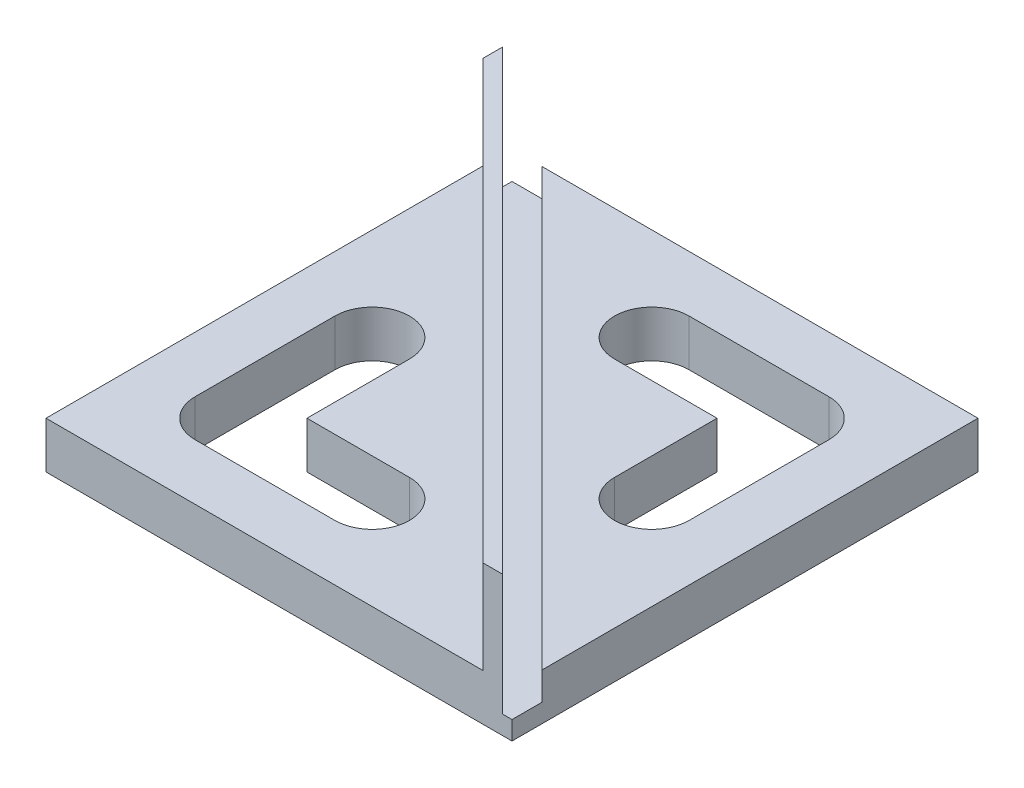
ISO-10303-21;
HEADER;
FILE_DESCRIPTION(('STEP AP214'),'2;1');
FILE_NAME('part.step','',(''),(''),'','','');
FILE_SCHEMA(('AUTOMOTIVE_DESIGN { 1 0 10303 214 1 1 1 1 }'));
ENDSEC;
DATA;
#1=APPLICATION_CONTEXT('core data for automotive mechanical design processes');
#2=APPLICATION_PROTOCOL_DEFINITION('international standard','automotive_design',2000,#1);
#3=PRODUCT_CONTEXT('',#1,'mechanical');
#4=PRODUCT('Part','Part','',(#3));
#5=PRODUCT_RELATED_PRODUCT_CATEGORY('part','',(#4));
#6=PRODUCT_DEFINITION_FORMATION('','',#4);
#7=PRODUCT_DEFINITION_CONTEXT('part definition',#1,'design');
#8=PRODUCT_DEFINITION('design','',#6,#7);
#9=PRODUCT_DEFINITION_SHAPE('','',#8);
#10=(LENGTH_UNIT() NAMED_UNIT(*) SI_UNIT(.MILLI.,.METRE.));
#11=(NAMED_UNIT(*) PLANE_ANGLE_UNIT() SI_UNIT($,.RADIAN.));
#12=(NAMED_UNIT(*) SI_UNIT($,.STERADIAN.) SOLID_ANGLE_UNIT());
#13=UNCERTAINTY_MEASURE_WITH_UNIT(LENGTH_MEASURE(1.E-05),#10,'distance_accuracy_value','');
#14=(GEOMETRIC_REPRESENTATION_CONTEXT(3) GLOBAL_UNCERTAINTY_ASSIGNED_CONTEXT((#13)) GLOBAL_UNIT_ASSIGNED_CONTEXT((#10,
#11,#12)) REPRESENTATION_CONTEXT('',''));
#15=CARTESIAN_POINT('',(0.,0.,0.));
#16=DIRECTION('',(0.,0.,1.));
#17=DIRECTION('',(1.,0.,0.));
#18=AXIS2_PLACEMENT_3D('',#15,#16,#17);
#19=CARTESIAN_POINT('',(0.,5.,0.));
#20=DIRECTION('',(0.,1.,0.));
#21=DIRECTION('',(0.,0.,1.));
#22=AXIS2_PLACEMENT_3D('',#19,#20,#21);
#23=PLANE('',#22);
#24=DIRECTION('',(-0.707106781186547,0.,-0.707106781186548));
#25=VECTOR('',#24,1.);
#26=CARTESIAN_POINT('',(-21.7573593128808,5.,-25.));
#27=LINE('',#26,#25);
#28=CARTESIAN_POINT('',(25.,5.,21.7573593128809));
#29=VERTEX_POINT('',#28);
#30=CARTESIAN_POINT('',(-21.7573593128808,5.,-25.));
#31=VERTEX_POINT('',#30);
#32=EDGE_CURVE('E207',#29,#31,#27,.T.);
#33=ORIENTED_EDGE('',*,*,#32,.F.);
#34=DIRECTION('',(0.,0.,-1.));
#35=VECTOR('',#34,1.);
#36=CARTESIAN_POINT('',(25.,5.,-25.));
#37=LINE('',#36,#35);
#38=CARTESIAN_POINT('',(25.,5.,-25.));
#39=VERTEX_POINT('',#38);
#40=EDGE_CURVE('E249',#29,#39,#37,.T.);
#41=ORIENTED_EDGE('',*,*,#40,.T.);
#42=DIRECTION('',(-1.,0.,0.));
#43=VECTOR('',#42,1.);
#44=CARTESIAN_POINT('',(-25.,5.,-25.));
#45=LINE('',#44,#43);
#46=EDGE_CURVE('E232',#39,#31,#45,.T.);
#47=ORIENTED_EDGE('',*,*,#46,.T.);
#48=EDGE_LOOP('',(#33,#41,#47));
#49=FACE_BOUND('',#48,.T.);
#50=DIRECTION('',(-1.,0.,0.));
#51=VECTOR('',#50,1.);
#52=CARTESIAN_POINT('',(15.,5.,-19.));
#53=LINE('',#52,#51);
#54=CARTESIAN_POINT('',(15.,5.,-19.));
#55=VERTEX_POINT('',#54);
#56=CARTESIAN_POINT('',(0.,5.,-19.));
#57=VERTEX_POINT('',#56);
#58=EDGE_CURVE('E383',#55,#57,#53,.T.);
#59=ORIENTED_EDGE('',*,*,#58,.F.);
#60=CARTESIAN_POINT('',(15.,5.,-15.));
#61=DIRECTION('',(0.,1.,0.));
#62=DIRECTION('',(0.,0.,1.));
#63=AXIS2_PLACEMENT_3D('',#60,#61,#62);
#64=CIRCLE('',#63,4.);
#65=CARTESIAN_POINT('',(19.,5.,-15.));
#66=VERTEX_POINT('',#65);
#67=EDGE_CURVE('E381',#66,#55,#64,.T.);
#68=ORIENTED_EDGE('',*,*,#67,.F.);
#69=DIRECTION('',(0.,0.,-1.));
#70=VECTOR('',#69,1.);
#71=CARTESIAN_POINT('',(19.,5.,0.));
#72=LINE('',#71,#70);
#73=CARTESIAN_POINT('',(19.,5.,0.));
#74=VERTEX_POINT('',#73);
#75=EDGE_CURVE('E395',#74,#66,#72,.T.);
#76=ORIENTED_EDGE('',*,*,#75,.F.);
#77=CARTESIAN_POINT('',(14.9999999999999,5.,0.));
#78=DIRECTION('',(0.,1.,0.));
#79=DIRECTION('',(0.,0.,1.));
#80=AXIS2_PLACEMENT_3D('',#77,#78,#79);
#81=CIRCLE('',#80,4.00000000000003);
#82=CARTESIAN_POINT('',(10.9999999999999,5.,0.));
#83=VERTEX_POINT('',#82);
#84=EDGE_CURVE('E392',#83,#74,#81,.T.);
#85=ORIENTED_EDGE('',*,*,#84,.F.);
#86=DIRECTION('',(0.,0.,1.));
#87=VECTOR('',#86,1.);
#88=CARTESIAN_POINT('',(11.,5.,-11.));
#89=LINE('',#88,#87);
#90=CARTESIAN_POINT('',(11.,5.,-11.));
#91=VERTEX_POINT('',#90);
#92=EDGE_CURVE('E390',#91,#83,#89,.T.);
#93=ORIENTED_EDGE('',*,*,#92,.F.);
#94=DIRECTION('',(1.,0.,0.));
#95=VECTOR('',#94,1.);
#96=CARTESIAN_POINT('',(0.,5.,-11.));
#97=LINE('',#96,#95);
#98=CARTESIAN_POINT('',(0.,5.,-11.));
#99=VERTEX_POINT('',#98);
#100=EDGE_CURVE('E388',#99,#91,#97,.T.);
#101=ORIENTED_EDGE('',*,*,#100,.F.);
#102=CARTESIAN_POINT('',(0.,5.,-15.));
#103=DIRECTION('',(0.,1.,0.));
#104=DIRECTION('',(0.,0.,1.));
#105=AXIS2_PLACEMENT_3D('',#102,#103,#104);
#106=CIRCLE('',#105,4.);
#107=EDGE_CURVE('E386',#57,#99,#106,.T.);
#108=ORIENTED_EDGE('',*,*,#107,.F.);
#109=EDGE_LOOP('',(#59,#68,#76,#85,#93,#101,#108));
#110=FACE_BOUND('',#109,.T.);
#111=ADVANCED_FACE('F33',(#49,#110),#23,.T.);
#112=DIRECTION('',(0.707106781186546,0.,0.707106781186549));
#113=VECTOR('',#112,1.);
#114=CARTESIAN_POINT('',(-25.,5.,-21.8786796564403));
#115=LINE('',#114,#113);
#116=CARTESIAN_POINT('',(-25.,5.,-21.8786796564403));
#117=VERTEX_POINT('',#116);
#118=CARTESIAN_POINT('',(21.8786796564402,5.,25.));
#119=VERTEX_POINT('',#118);
#120=EDGE_CURVE('E50',#117,#119,#115,.T.);
#121=ORIENTED_EDGE('',*,*,#120,.F.);
#122=DIRECTION('',(0.,0.,1.));
#123=VECTOR('',#122,1.);
#124=CARTESIAN_POINT('',(-25.,5.,-25.));
#125=LINE('',#124,#123);
#126=CARTESIAN_POINT('',(-25.,5.,25.));
#127=VERTEX_POINT('',#126);
#128=EDGE_CURVE('E228',#117,#127,#125,.T.);
#129=ORIENTED_EDGE('',*,*,#128,.T.);
#130=DIRECTION('',(1.,0.,0.));
#131=VECTOR('',#130,1.);
#132=CARTESIAN_POINT('',(-25.,5.,25.));
#133=LINE('',#132,#131);
#134=EDGE_CURVE('E231',#127,#119,#133,.T.);
#135=ORIENTED_EDGE('',*,*,#134,.T.);
#136=EDGE_LOOP('',(#121,#129,#135));
#137=FACE_BOUND('',#136,.T.);
#138=DIRECTION('',(1.,0.,0.));
#139=VECTOR('',#138,1.);
#140=CARTESIAN_POINT('',(-15.,5.,19.));
#141=LINE('',#140,#139);
#142=CARTESIAN_POINT('',(-15.,5.,19.));
#143=VERTEX_POINT('',#142);
#144=CARTESIAN_POINT('',(0.,5.,19.));
#145=VERTEX_POINT('',#144);
#146=EDGE_CURVE('E333',#143,#145,#141,.T.);
#147=ORIENTED_EDGE('',*,*,#146,.F.);
#148=CARTESIAN_POINT('',(-15.,5.,15.));
#149=DIRECTION('',(0.,1.,0.));
#150=DIRECTION('',(0.,0.,1.));
#151=AXIS2_PLACEMENT_3D('',#148,#149,#150);
#152=CIRCLE('',#151,4.);
#153=CARTESIAN_POINT('',(-19.,5.,15.));
#154=VERTEX_POINT('',#153);
#155=EDGE_CURVE('E331',#154,#143,#152,.T.);
#156=ORIENTED_EDGE('',*,*,#155,.F.);
#157=DIRECTION('',(0.,0.,1.));
#158=VECTOR('',#157,1.);
#159=CARTESIAN_POINT('',(-19.,5.,0.));
#160=LINE('',#159,#158);
#161=CARTESIAN_POINT('',(-19.,5.,0.));
#162=VERTEX_POINT('',#161);
#163=EDGE_CURVE('E344',#162,#154,#160,.T.);
#164=ORIENTED_EDGE('',*,*,#163,.F.);
#165=CARTESIAN_POINT('',(-15.,5.,0.));
#166=DIRECTION('',(0.,1.,0.));
#167=DIRECTION('',(0.,0.,1.));
#168=AXIS2_PLACEMENT_3D('',#165,#166,#167);
#169=CIRCLE('',#168,4.);
#170=CARTESIAN_POINT('',(-11.,5.,0.));
#171=VERTEX_POINT('',#170);
#172=EDGE_CURVE('E342',#171,#162,#169,.T.);
#173=ORIENTED_EDGE('',*,*,#172,.F.);
#174=DIRECTION('',(0.,0.,-1.));
#175=VECTOR('',#174,1.);
#176=CARTESIAN_POINT('',(-11.,5.,11.));
#177=LINE('',#176,#175);
#178=CARTESIAN_POINT('',(-11.,5.,11.));
#179=VERTEX_POINT('',#178);
#180=EDGE_CURVE('E340',#179,#171,#177,.T.);
#181=ORIENTED_EDGE('',*,*,#180,.F.);
#182=DIRECTION('',(-1.,0.,0.));
#183=VECTOR('',#182,1.);
#184=CARTESIAN_POINT('',(0.,5.,11.));
#185=LINE('',#184,#183);
#186=CARTESIAN_POINT('',(0.,5.,11.));
#187=VERTEX_POINT('',#186);
#188=EDGE_CURVE('E338',#187,#179,#185,.T.);
#189=ORIENTED_EDGE('',*,*,#188,.F.);
#190=CARTESIAN_POINT('',(0.,5.,15.));
#191=DIRECTION('',(0.,1.,0.));
#192=DIRECTION('',(0.,0.,1.));
#193=AXIS2_PLACEMENT_3D('',#190,#191,#192);
#194=CIRCLE('',#193,4.);
#195=EDGE_CURVE('E336',#145,#187,#194,.T.);
#196=ORIENTED_EDGE('',*,*,#195,.F.);
#197=EDGE_LOOP('',(#147,#156,#164,#173,#181,#189,#196));
#198=FACE_BOUND('',#197,.T.);
#199=ADVANCED_FACE('F254',(#137,#198),#23,.T.);
#200=CARTESIAN_POINT('',(0.,0.,0.));
#201=DIRECTION('',(0.,1.,0.));
#202=DIRECTION('',(0.,0.,1.));
#203=AXIS2_PLACEMENT_3D('',#200,#201,#202);
#204=PLANE('',#203);
#205=CARTESIAN_POINT('',(15.,0.,-15.));
#206=DIRECTION('',(0.,1.,0.));
#207=DIRECTION('',(0.,0.,1.));
#208=AXIS2_PLACEMENT_3D('',#205,#206,#207);
#209=CIRCLE('',#208,4.);
#210=CARTESIAN_POINT('',(19.,0.,-15.));
#211=VERTEX_POINT('',#210);
#212=CARTESIAN_POINT('',(15.,0.,-19.));
#213=VERTEX_POINT('',#212);
#214=EDGE_CURVE('E380',#211,#213,#209,.T.);
#215=ORIENTED_EDGE('',*,*,#214,.T.);
#216=DIRECTION('',(-1.,0.,0.));
#217=VECTOR('',#216,1.);
#218=CARTESIAN_POINT('',(15.,0.,-19.));
#219=LINE('',#218,#217);
#220=CARTESIAN_POINT('',(0.,0.,-19.));
#221=VERTEX_POINT('',#220);
#222=EDGE_CURVE('E400',#213,#221,#219,.T.);
#223=ORIENTED_EDGE('',*,*,#222,.T.);
#224=CARTESIAN_POINT('',(0.,0.,-15.));
#225=DIRECTION('',(0.,1.,0.));
#226=DIRECTION('',(0.,0.,1.));
#227=AXIS2_PLACEMENT_3D('',#224,#225,#226);
#228=CIRCLE('',#227,4.);
#229=CARTESIAN_POINT('',(0.,0.,-11.));
#230=VERTEX_POINT('',#229);
#231=EDGE_CURVE('E403',#221,#230,#228,.T.);
#232=ORIENTED_EDGE('',*,*,#231,.T.);
#233=DIRECTION('',(1.,0.,0.));
#234=VECTOR('',#233,1.);
#235=CARTESIAN_POINT('',(0.,0.,-11.));
#236=LINE('',#235,#234);
#237=CARTESIAN_POINT('',(11.,0.,-11.));
#238=VERTEX_POINT('',#237);
#239=EDGE_CURVE('E406',#230,#238,#236,.T.);
#240=ORIENTED_EDGE('',*,*,#239,.T.);
#241=DIRECTION('',(0.,0.,1.));
#242=VECTOR('',#241,1.);
#243=CARTESIAN_POINT('',(11.,0.,-11.));
#244=LINE('',#243,#242);
#245=CARTESIAN_POINT('',(10.9999999999999,0.,0.));
#246=VERTEX_POINT('',#245);
#247=EDGE_CURVE('E409',#238,#246,#244,.T.);
#248=ORIENTED_EDGE('',*,*,#247,.T.);
#249=CARTESIAN_POINT('',(14.9999999999999,0.,0.));
#250=DIRECTION('',(0.,1.,0.));
#251=DIRECTION('',(0.,0.,1.));
#252=AXIS2_PLACEMENT_3D('',#249,#250,#251);
#253=CIRCLE('',#252,4.00000000000003);
#254=CARTESIAN_POINT('',(19.,0.,0.));
#255=VERTEX_POINT('',#254);
#256=EDGE_CURVE('E412',#246,#255,#253,.T.);
#257=ORIENTED_EDGE('',*,*,#256,.T.);
#258=DIRECTION('',(0.,0.,-1.));
#259=VECTOR('',#258,1.);
#260=CARTESIAN_POINT('',(19.,0.,0.));
#261=LINE('',#260,#259);
#262=EDGE_CURVE('E384',#255,#211,#261,.T.);
#263=ORIENTED_EDGE('',*,*,#262,.T.);
#264=EDGE_LOOP('',(#215,#223,#232,#240,#248,#257,#263));
#265=FACE_BOUND('',#264,.T.);
#266=DIRECTION('',(0.,0.,-1.));
#267=VECTOR('',#266,1.);
#268=CARTESIAN_POINT('',(25.,0.,-25.));
#269=LINE('',#268,#267);
#270=CARTESIAN_POINT('',(25.,0.,25.));
#271=VERTEX_POINT('',#270);
#272=CARTESIAN_POINT('',(25.,0.,-25.));
#273=VERTEX_POINT('',#272);
#274=EDGE_CURVE('E240',#271,#273,#269,.T.);
#275=ORIENTED_EDGE('',*,*,#274,.F.);
#276=DIRECTION('',(1.,0.,0.));
#277=VECTOR('',#276,1.);
#278=CARTESIAN_POINT('',(-25.,0.,25.));
#279=LINE('',#278,#277);
#280=CARTESIAN_POINT('',(-25.,0.,25.));
#281=VERTEX_POINT('',#280);
#282=EDGE_CURVE('E247',#281,#271,#279,.T.);
#283=ORIENTED_EDGE('',*,*,#282,.F.);
#284=DIRECTION('',(0.,0.,1.));
#285=VECTOR('',#284,1.);
#286=CARTESIAN_POINT('',(-25.,0.,-25.));
#287=LINE('',#286,#285);
#288=CARTESIAN_POINT('',(-25.,0.,-25.));
#289=VERTEX_POINT('',#288);
#290=EDGE_CURVE('E245',#289,#281,#287,.T.);
#291=ORIENTED_EDGE('',*,*,#290,.F.);
#292=DIRECTION('',(-1.,0.,0.));
#293=VECTOR('',#292,1.);
#294=CARTESIAN_POINT('',(-25.,0.,-25.));
#295=LINE('',#294,#293);
#296=EDGE_CURVE('E219',#273,#289,#295,.T.);
#297=ORIENTED_EDGE('',*,*,#296,.F.);
#298=EDGE_LOOP('',(#275,#283,#291,#297));
#299=FACE_BOUND('',#298,.T.);
#300=CARTESIAN_POINT('',(-15.,0.,15.));
#301=DIRECTION('',(0.,1.,0.));
#302=DIRECTION('',(0.,0.,1.));
#303=AXIS2_PLACEMENT_3D('',#300,#301,#302);
#304=CIRCLE('',#303,4.);
#305=CARTESIAN_POINT('',(-19.,0.,15.));
#306=VERTEX_POINT('',#305);
#307=CARTESIAN_POINT('',(-15.,0.,19.));
#308=VERTEX_POINT('',#307);
#309=EDGE_CURVE('E275',#306,#308,#304,.T.);
#310=ORIENTED_EDGE('',*,*,#309,.T.);
#311=DIRECTION('',(1.,0.,0.));
#312=VECTOR('',#311,1.);
#313=CARTESIAN_POINT('',(-15.,0.,19.));
#314=LINE('',#313,#312);
#315=CARTESIAN_POINT('',(0.,0.,19.));
#316=VERTEX_POINT('',#315);
#317=EDGE_CURVE('E349',#308,#316,#314,.T.);
#318=ORIENTED_EDGE('',*,*,#317,.T.);
#319=CARTESIAN_POINT('',(0.,0.,15.));
#320=DIRECTION('',(0.,1.,0.));
#321=DIRECTION('',(0.,0.,1.));
#322=AXIS2_PLACEMENT_3D('',#319,#320,#321);
#323=CIRCLE('',#322,4.);
#324=CARTESIAN_POINT('',(0.,0.,11.));
#325=VERTEX_POINT('',#324);
#326=EDGE_CURVE('E352',#316,#325,#323,.T.);
#327=ORIENTED_EDGE('',*,*,#326,.T.);
#328=DIRECTION('',(-1.,0.,0.));
#329=VECTOR('',#328,1.);
#330=CARTESIAN_POINT('',(0.,0.,11.));
#331=LINE('',#330,#329);
#332=CARTESIAN_POINT('',(-11.,0.,11.));
#333=VERTEX_POINT('',#332);
#334=EDGE_CURVE('E355',#325,#333,#331,.T.);
#335=ORIENTED_EDGE('',*,*,#334,.T.);
#336=DIRECTION('',(0.,0.,-1.));
#337=VECTOR('',#336,1.);
#338=CARTESIAN_POINT('',(-11.,0.,11.));
#339=LINE('',#338,#337);
#340=CARTESIAN_POINT('',(-11.,0.,0.));
#341=VERTEX_POINT('',#340);
#342=EDGE_CURVE('E358',#333,#341,#339,.T.);
#343=ORIENTED_EDGE('',*,*,#342,.T.);
#344=CARTESIAN_POINT('',(-15.,0.,0.));
#345=DIRECTION('',(0.,1.,0.));
#346=DIRECTION('',(0.,0.,1.));
#347=AXIS2_PLACEMENT_3D('',#344,#345,#346);
#348=CIRCLE('',#347,4.);
#349=CARTESIAN_POINT('',(-19.,0.,0.));
#350=VERTEX_POINT('',#349);
#351=EDGE_CURVE('E361',#341,#350,#348,.T.);
#352=ORIENTED_EDGE('',*,*,#351,.T.);
#353=DIRECTION('',(0.,0.,1.));
#354=VECTOR('',#353,1.);
#355=CARTESIAN_POINT('',(-19.,0.,0.));
#356=LINE('',#355,#354);
#357=EDGE_CURVE('E334',#350,#306,#356,.T.);
#358=ORIENTED_EDGE('',*,*,#357,.T.);
#359=EDGE_LOOP('',(#310,#318,#327,#335,#343,#352,#358));
#360=FACE_BOUND('',#359,.T.);
#361=ADVANCED_FACE('F441',(#265,#299,#360),#204,.F.);
#362=CARTESIAN_POINT('',(25.,5.,-25.));
#363=DIRECTION('',(-1.,0.,0.));
#364=DIRECTION('',(0.,0.,1.));
#365=AXIS2_PLACEMENT_3D('',#362,#363,#364);
#366=PLANE('',#365);
#367=ORIENTED_EDGE('',*,*,#40,.F.);
#368=DIRECTION('',(0.,1.,0.));
#369=VECTOR('',#368,1.);
#370=CARTESIAN_POINT('',(25.,2.,21.7573593128809));
#371=LINE('',#370,#369);
#372=CARTESIAN_POINT('',(25.,2.,21.7573593128809));
#373=VERTEX_POINT('',#372);
#374=EDGE_CURVE('E320',#373,#29,#371,.T.);
#375=ORIENTED_EDGE('',*,*,#374,.F.);
#376=DIRECTION('',(0.,0.,-1.));
#377=VECTOR('',#376,1.);
#378=CARTESIAN_POINT('',(25.,2.,21.7573593128809));
#379=LINE('',#378,#377);
#380=CARTESIAN_POINT('',(25.,2.,25.));
#381=VERTEX_POINT('',#380);
#382=EDGE_CURVE('E317',#381,#373,#379,.T.);
#383=ORIENTED_EDGE('',*,*,#382,.F.);
#384=DIRECTION('',(0.,-1.,0.));
#385=VECTOR('',#384,1.);
#386=CARTESIAN_POINT('',(25.,5.,25.));
#387=LINE('',#386,#385);
#388=EDGE_CURVE('E224',#381,#271,#387,.T.);
#389=ORIENTED_EDGE('',*,*,#388,.T.);
#390=ORIENTED_EDGE('',*,*,#274,.T.);
#391=DIRECTION('',(0.,-1.,0.));
#392=VECTOR('',#391,1.);
#393=CARTESIAN_POINT('',(25.,5.,-25.));
#394=LINE('',#393,#392);
#395=EDGE_CURVE('E11',#39,#273,#394,.T.);
#396=ORIENTED_EDGE('',*,*,#395,.F.);
#397=EDGE_LOOP('',(#367,#375,#383,#389,#390,#396));
#398=FACE_BOUND('',#397,.T.);
#399=ADVANCED_FACE('F35',(#398),#366,.F.);
#400=CARTESIAN_POINT('',(-25.,5.,-25.));
#401=DIRECTION('',(0.,0.,1.));
#402=DIRECTION('',(1.,0.,0.));
#403=AXIS2_PLACEMENT_3D('',#400,#401,#402);
#404=PLANE('',#403);
#405=DIRECTION('',(-1.,0.,0.));
#406=VECTOR('',#405,1.);
#407=CARTESIAN_POINT('',(-25.,2.,-25.));
#408=LINE('',#407,#406);
#409=CARTESIAN_POINT('',(-21.7573593128808,2.,-25.));
#410=VERTEX_POINT('',#409);
#411=CARTESIAN_POINT('',(-25.,2.,-25.));
#412=VERTEX_POINT('',#411);
#413=EDGE_CURVE('E197',#410,#412,#408,.T.);
#414=ORIENTED_EDGE('',*,*,#413,.F.);
#415=DIRECTION('',(0.,1.,0.));
#416=VECTOR('',#415,1.);
#417=CARTESIAN_POINT('',(-21.7573593128808,2.,-25.));
#418=LINE('',#417,#416);
#419=EDGE_CURVE('E268',#410,#31,#418,.T.);
#420=ORIENTED_EDGE('',*,*,#419,.T.);
#421=ORIENTED_EDGE('',*,*,#46,.F.);
#422=ORIENTED_EDGE('',*,*,#395,.T.);
#423=ORIENTED_EDGE('',*,*,#296,.T.);
#424=DIRECTION('',(0.,-1.,0.));
#425=VECTOR('',#424,1.);
#426=CARTESIAN_POINT('',(-25.,5.,-25.));
#427=LINE('',#426,#425);
#428=EDGE_CURVE('E42',#412,#289,#427,.T.);
#429=ORIENTED_EDGE('',*,*,#428,.F.);
#430=EDGE_LOOP('',(#414,#420,#421,#422,#423,#429));
#431=FACE_BOUND('',#430,.T.);
#432=ADVANCED_FACE('F218',(#431),#404,.F.);
#433=CARTESIAN_POINT('',(-25.,5.,-25.));
#434=DIRECTION('',(1.,0.,0.));
#435=DIRECTION('',(0.,0.,-1.));
#436=AXIS2_PLACEMENT_3D('',#433,#434,#435);
#437=PLANE('',#436);
#438=DIRECTION('',(0.,-1.,0.));
#439=VECTOR('',#438,1.);
#440=CARTESIAN_POINT('',(-25.,15.,-24.));
#441=LINE('',#440,#439);
#442=CARTESIAN_POINT('',(-25.,15.,-24.));
#443=VERTEX_POINT('',#442);
#444=CARTESIAN_POINT('',(-25.,2.,-24.));
#445=VERTEX_POINT('',#444);
#446=EDGE_CURVE('E214',#443,#445,#441,.T.);
#447=ORIENTED_EDGE('',*,*,#446,.T.);
#448=DIRECTION('',(0.,0.,1.));
#449=VECTOR('',#448,1.);
#450=CARTESIAN_POINT('',(-25.,2.,-24.));
#451=LINE('',#450,#449);
#452=EDGE_CURVE('E201',#412,#445,#451,.T.);
#453=ORIENTED_EDGE('',*,*,#452,.F.);
#454=ORIENTED_EDGE('',*,*,#428,.T.);
#455=ORIENTED_EDGE('',*,*,#290,.T.);
#456=DIRECTION('',(0.,-1.,0.));
#457=VECTOR('',#456,1.);
#458=CARTESIAN_POINT('',(-25.,5.,25.));
#459=LINE('',#458,#457);
#460=EDGE_CURVE('E221',#127,#281,#459,.T.);
#461=ORIENTED_EDGE('',*,*,#460,.F.);
#462=ORIENTED_EDGE('',*,*,#128,.F.);
#463=DIRECTION('',(0.,-1.,0.));
#464=VECTOR('',#463,1.);
#465=CARTESIAN_POINT('',(-25.,15.,-21.8786796564403));
#466=LINE('',#465,#464);
#467=CARTESIAN_POINT('',(-25.,15.,-21.8786796564403));
#468=VERTEX_POINT('',#467);
#469=EDGE_CURVE('E266',#468,#117,#466,.T.);
#470=ORIENTED_EDGE('',*,*,#469,.F.);
#471=DIRECTION('',(0.,0.,1.));
#472=VECTOR('',#471,1.);
#473=CARTESIAN_POINT('',(-25.,15.,-24.));
#474=LINE('',#473,#472);
#475=EDGE_CURVE('E267',#443,#468,#474,.T.);
#476=ORIENTED_EDGE('',*,*,#475,.F.);
#477=EDGE_LOOP('',(#447,#453,#454,#455,#461,#462,#470,#476));
#478=FACE_BOUND('',#477,.T.);
#479=ADVANCED_FACE('F210',(#478),#437,.F.);
#480=CARTESIAN_POINT('',(-25.,5.,25.));
#481=DIRECTION('',(0.,0.,-1.));
#482=DIRECTION('',(-1.,0.,0.));
#483=AXIS2_PLACEMENT_3D('',#480,#481,#482);
#484=PLANE('',#483);
#485=DIRECTION('',(1.,0.,0.));
#486=VECTOR('',#485,1.);
#487=CARTESIAN_POINT('',(25.,2.,25.));
#488=LINE('',#487,#486);
#489=CARTESIAN_POINT('',(23.9999999999998,2.,25.));
#490=VERTEX_POINT('',#489);
#491=EDGE_CURVE('E315',#490,#381,#488,.T.);
#492=ORIENTED_EDGE('',*,*,#491,.F.);
#493=DIRECTION('',(0.,-1.,0.));
#494=VECTOR('',#493,1.);
#495=CARTESIAN_POINT('',(23.9999999999998,15.,25.));
#496=LINE('',#495,#494);
#497=CARTESIAN_POINT('',(23.9999999999998,15.,25.));
#498=VERTEX_POINT('',#497);
#499=EDGE_CURVE('E273',#498,#490,#496,.T.);
#500=ORIENTED_EDGE('',*,*,#499,.F.);
#501=DIRECTION('',(1.,0.,0.));
#502=VECTOR('',#501,1.);
#503=CARTESIAN_POINT('',(21.8786796564402,15.,25.));
#504=LINE('',#503,#502);
#505=CARTESIAN_POINT('',(21.8786796564402,15.,25.));
#506=VERTEX_POINT('',#505);
#507=EDGE_CURVE('E272',#506,#498,#504,.T.);
#508=ORIENTED_EDGE('',*,*,#507,.F.);
#509=DIRECTION('',(0.,-1.,0.));
#510=VECTOR('',#509,1.);
#511=CARTESIAN_POINT('',(21.8786796564402,15.,25.));
#512=LINE('',#511,#510);
#513=EDGE_CURVE('E263',#506,#119,#512,.T.);
#514=ORIENTED_EDGE('',*,*,#513,.T.);
#515=ORIENTED_EDGE('',*,*,#134,.F.);
#516=ORIENTED_EDGE('',*,*,#460,.T.);
#517=ORIENTED_EDGE('',*,*,#282,.T.);
#518=ORIENTED_EDGE('',*,*,#388,.F.);
#519=EDGE_LOOP('',(#492,#500,#508,#514,#515,#516,#517,#518));
#520=FACE_BOUND('',#519,.T.);
#521=ADVANCED_FACE('F270',(#520),#484,.F.);
#522=CARTESIAN_POINT('',(15.,5.,-15.));
#523=DIRECTION('',(0.,-1.,0.));
#524=DIRECTION('',(0.,0.,-1.));
#525=AXIS2_PLACEMENT_3D('',#522,#523,#524);
#526=CYLINDRICAL_SURFACE('',#525,4.);
#527=ORIENTED_EDGE('',*,*,#214,.F.);
#528=DIRECTION('',(0.,-1.,0.));
#529=VECTOR('',#528,1.);
#530=CARTESIAN_POINT('',(19.,5.,-15.));
#531=LINE('',#530,#529);
#532=EDGE_CURVE('E397',#66,#211,#531,.T.);
#533=ORIENTED_EDGE('',*,*,#532,.F.);
#534=ORIENTED_EDGE('',*,*,#67,.T.);
#535=DIRECTION('',(0.,-1.,0.));
#536=VECTOR('',#535,1.);
#537=CARTESIAN_POINT('',(15.,5.,-19.));
#538=LINE('',#537,#536);
#539=EDGE_CURVE('E243',#55,#213,#538,.T.);
#540=ORIENTED_EDGE('',*,*,#539,.T.);
#541=EDGE_LOOP('',(#527,#533,#534,#540));
#542=FACE_BOUND('',#541,.T.);
#543=ADVANCED_FACE('F465',(#542),#526,.F.);
#544=CARTESIAN_POINT('',(15.,5.,-19.));
#545=DIRECTION('',(0.,0.,1.));
#546=DIRECTION('',(1.,0.,0.));
#547=AXIS2_PLACEMENT_3D('',#544,#545,#546);
#548=PLANE('',#547);
#549=ORIENTED_EDGE('',*,*,#222,.F.);
#550=ORIENTED_EDGE('',*,*,#539,.F.);
#551=ORIENTED_EDGE('',*,*,#58,.T.);
#552=DIRECTION('',(0.,-1.,0.));
#553=VECTOR('',#552,1.);
#554=CARTESIAN_POINT('',(0.,5.,-19.));
#555=LINE('',#554,#553);
#556=EDGE_CURVE('E427',#57,#221,#555,.T.);
#557=ORIENTED_EDGE('',*,*,#556,.T.);
#558=EDGE_LOOP('',(#549,#550,#551,#557));
#559=FACE_BOUND('',#558,.T.);
#560=ADVANCED_FACE('F700',(#559),#548,.T.);
#561=CARTESIAN_POINT('',(0.,5.,-15.));
#562=DIRECTION('',(0.,-1.,0.));
#563=DIRECTION('',(0.,0.,-1.));
#564=AXIS2_PLACEMENT_3D('',#561,#562,#563);
#565=CYLINDRICAL_SURFACE('',#564,4.);
#566=ORIENTED_EDGE('',*,*,#231,.F.);
#567=ORIENTED_EDGE('',*,*,#556,.F.);
#568=ORIENTED_EDGE('',*,*,#107,.T.);
#569=DIRECTION('',(0.,-1.,0.));
#570=VECTOR('',#569,1.);
#571=CARTESIAN_POINT('',(0.,5.,-11.));
#572=LINE('',#571,#570);
#573=EDGE_CURVE('E425',#99,#230,#572,.T.);
#574=ORIENTED_EDGE('',*,*,#573,.T.);
#575=EDGE_LOOP('',(#566,#567,#568,#574));
#576=FACE_BOUND('',#575,.T.);
#577=ADVANCED_FACE('F692',(#576),#565,.F.);
#578=CARTESIAN_POINT('',(0.,5.,-11.));
#579=DIRECTION('',(0.,0.,-1.));
#580=DIRECTION('',(-1.,0.,0.));
#581=AXIS2_PLACEMENT_3D('',#578,#579,#580);
#582=PLANE('',#581);
#583=ORIENTED_EDGE('',*,*,#239,.F.);
#584=ORIENTED_EDGE('',*,*,#573,.F.);
#585=ORIENTED_EDGE('',*,*,#100,.T.);
#586=DIRECTION('',(0.,-1.,0.));
#587=VECTOR('',#586,1.);
#588=CARTESIAN_POINT('',(11.,5.,-11.));
#589=LINE('',#588,#587);
#590=EDGE_CURVE('E423',#91,#238,#589,.T.);
#591=ORIENTED_EDGE('',*,*,#590,.T.);
#592=EDGE_LOOP('',(#583,#584,#585,#591));
#593=FACE_BOUND('',#592,.T.);
#594=ADVANCED_FACE('F684',(#593),#582,.T.);
#595=CARTESIAN_POINT('',(11.,5.,-11.));
#596=DIRECTION('',(1.,0.,0.));
#597=DIRECTION('',(0.,0.,-1.));
#598=AXIS2_PLACEMENT_3D('',#595,#596,#597);
#599=PLANE('',#598);
#600=ORIENTED_EDGE('',*,*,#247,.F.);
#601=ORIENTED_EDGE('',*,*,#590,.F.);
#602=ORIENTED_EDGE('',*,*,#92,.T.);
#603=DIRECTION('',(0.,-1.,0.));
#604=VECTOR('',#603,1.);
#605=CARTESIAN_POINT('',(10.9999999999999,5.,0.));
#606=LINE('',#605,#604);
#607=EDGE_CURVE('E421',#83,#246,#606,.T.);
#608=ORIENTED_EDGE('',*,*,#607,.T.);
#609=EDGE_LOOP('',(#600,#601,#602,#608));
#610=FACE_BOUND('',#609,.T.);
#611=ADVANCED_FACE('F676',(#610),#599,.T.);
#612=CARTESIAN_POINT('',(14.9999999999999,5.,0.));
#613=DIRECTION('',(0.,-1.,0.));
#614=DIRECTION('',(0.,0.,-1.));
#615=AXIS2_PLACEMENT_3D('',#612,#613,#614);
#616=CYLINDRICAL_SURFACE('',#615,4.00000000000003);
#617=ORIENTED_EDGE('',*,*,#256,.F.);
#618=ORIENTED_EDGE('',*,*,#607,.F.);
#619=ORIENTED_EDGE('',*,*,#84,.T.);
#620=DIRECTION('',(0.,-1.,0.));
#621=VECTOR('',#620,1.);
#622=CARTESIAN_POINT('',(19.,5.,0.));
#623=LINE('',#622,#621);
#624=EDGE_CURVE('E419',#74,#255,#623,.T.);
#625=ORIENTED_EDGE('',*,*,#624,.T.);
#626=EDGE_LOOP('',(#617,#618,#619,#625));
#627=FACE_BOUND('',#626,.T.);
#628=ADVANCED_FACE('F668',(#627),#616,.F.);
#629=CARTESIAN_POINT('',(19.,5.,0.));
#630=DIRECTION('',(-1.,0.,0.));
#631=DIRECTION('',(0.,0.,1.));
#632=AXIS2_PLACEMENT_3D('',#629,#630,#631);
#633=PLANE('',#632);
#634=ORIENTED_EDGE('',*,*,#262,.F.);
#635=ORIENTED_EDGE('',*,*,#624,.F.);
#636=ORIENTED_EDGE('',*,*,#75,.T.);
#637=ORIENTED_EDGE('',*,*,#532,.T.);
#638=EDGE_LOOP('',(#634,#635,#636,#637));
#639=FACE_BOUND('',#638,.T.);
#640=ADVANCED_FACE('F660',(#639),#633,.T.);
#641=CARTESIAN_POINT('',(-15.,5.,15.));
#642=DIRECTION('',(0.,-1.,0.));
#643=DIRECTION('',(0.,0.,-1.));
#644=AXIS2_PLACEMENT_3D('',#641,#642,#643);
#645=CYLINDRICAL_SURFACE('',#644,4.);
#646=ORIENTED_EDGE('',*,*,#309,.F.);
#647=DIRECTION('',(0.,-1.,0.));
#648=VECTOR('',#647,1.);
#649=CARTESIAN_POINT('',(-19.,5.,15.));
#650=LINE('',#649,#648);
#651=EDGE_CURVE('E346',#154,#306,#650,.T.);
#652=ORIENTED_EDGE('',*,*,#651,.F.);
#653=ORIENTED_EDGE('',*,*,#155,.T.);
#654=DIRECTION('',(0.,-1.,0.));
#655=VECTOR('',#654,1.);
#656=CARTESIAN_POINT('',(-15.,5.,19.));
#657=LINE('',#656,#655);
#658=EDGE_CURVE('E377',#143,#308,#657,.T.);
#659=ORIENTED_EDGE('',*,*,#658,.T.);
#660=EDGE_LOOP('',(#646,#652,#653,#659));
#661=FACE_BOUND('',#660,.T.);
#662=ADVANCED_FACE('F652',(#661),#645,.F.);
#663=CARTESIAN_POINT('',(-15.,5.,19.));
#664=DIRECTION('',(0.,0.,-1.));
#665=DIRECTION('',(-1.,0.,0.));
#666=AXIS2_PLACEMENT_3D('',#663,#664,#665);
#667=PLANE('',#666);
#668=ORIENTED_EDGE('',*,*,#317,.F.);
#669=ORIENTED_EDGE('',*,*,#658,.F.);
#670=ORIENTED_EDGE('',*,*,#146,.T.);
#671=DIRECTION('',(0.,-1.,0.));
#672=VECTOR('',#671,1.);
#673=CARTESIAN_POINT('',(0.,5.,19.));
#674=LINE('',#673,#672);
#675=EDGE_CURVE('E375',#145,#316,#674,.T.);
#676=ORIENTED_EDGE('',*,*,#675,.T.);
#677=EDGE_LOOP('',(#668,#669,#670,#676));
#678=FACE_BOUND('',#677,.T.);
#679=ADVANCED_FACE('F644',(#678),#667,.T.);
#680=CARTESIAN_POINT('',(0.,5.,15.));
#681=DIRECTION('',(0.,-1.,0.));
#682=DIRECTION('',(0.,0.,-1.));
#683=AXIS2_PLACEMENT_3D('',#680,#681,#682);
#684=CYLINDRICAL_SURFACE('',#683,4.);
#685=ORIENTED_EDGE('',*,*,#326,.F.);
#686=ORIENTED_EDGE('',*,*,#675,.F.);
#687=ORIENTED_EDGE('',*,*,#195,.T.);
#688=DIRECTION('',(0.,-1.,0.));
#689=VECTOR('',#688,1.);
#690=CARTESIAN_POINT('',(0.,5.,11.));
#691=LINE('',#690,#689);
#692=EDGE_CURVE('E373',#187,#325,#691,.T.);
#693=ORIENTED_EDGE('',*,*,#692,.T.);
#694=EDGE_LOOP('',(#685,#686,#687,#693));
#695=FACE_BOUND('',#694,.T.);
#696=ADVANCED_FACE('F636',(#695),#684,.F.);
#697=CARTESIAN_POINT('',(0.,5.,11.));
#698=DIRECTION('',(0.,0.,1.));
#699=DIRECTION('',(1.,0.,0.));
#700=AXIS2_PLACEMENT_3D('',#697,#698,#699);
#701=PLANE('',#700);
#702=ORIENTED_EDGE('',*,*,#334,.F.);
#703=ORIENTED_EDGE('',*,*,#692,.F.);
#704=ORIENTED_EDGE('',*,*,#188,.T.);
#705=DIRECTION('',(0.,-1.,0.));
#706=VECTOR('',#705,1.);
#707=CARTESIAN_POINT('',(-11.,5.,11.));
#708=LINE('',#707,#706);
#709=EDGE_CURVE('E371',#179,#333,#708,.T.);
#710=ORIENTED_EDGE('',*,*,#709,.T.);
#711=EDGE_LOOP('',(#702,#703,#704,#710));
#712=FACE_BOUND('',#711,.T.);
#713=ADVANCED_FACE('F628',(#712),#701,.T.);
#714=CARTESIAN_POINT('',(-11.,5.,11.));
#715=DIRECTION('',(-1.,0.,0.));
#716=DIRECTION('',(0.,0.,1.));
#717=AXIS2_PLACEMENT_3D('',#714,#715,#716);
#718=PLANE('',#717);
#719=ORIENTED_EDGE('',*,*,#342,.F.);
#720=ORIENTED_EDGE('',*,*,#709,.F.);
#721=ORIENTED_EDGE('',*,*,#180,.T.);
#722=DIRECTION('',(0.,-1.,0.));
#723=VECTOR('',#722,1.);
#724=CARTESIAN_POINT('',(-11.,5.,0.));
#725=LINE('',#724,#723);
#726=EDGE_CURVE('E369',#171,#341,#725,.T.);
#727=ORIENTED_EDGE('',*,*,#726,.T.);
#728=EDGE_LOOP('',(#719,#720,#721,#727));
#729=FACE_BOUND('',#728,.T.);
#730=ADVANCED_FACE('F621',(#729),#718,.T.);
#731=CARTESIAN_POINT('',(-15.,5.,0.));
#732=DIRECTION('',(0.,-1.,0.));
#733=DIRECTION('',(0.,0.,-1.));
#734=AXIS2_PLACEMENT_3D('',#731,#732,#733);
#735=CYLINDRICAL_SURFACE('',#734,4.);
#736=ORIENTED_EDGE('',*,*,#351,.F.);
#737=ORIENTED_EDGE('',*,*,#726,.F.);
#738=ORIENTED_EDGE('',*,*,#172,.T.);
#739=DIRECTION('',(0.,-1.,0.));
#740=VECTOR('',#739,1.);
#741=CARTESIAN_POINT('',(-19.,5.,0.));
#742=LINE('',#741,#740);
#743=EDGE_CURVE('E58',#162,#350,#742,.T.);
#744=ORIENTED_EDGE('',*,*,#743,.T.);
#745=EDGE_LOOP('',(#736,#737,#738,#744));
#746=FACE_BOUND('',#745,.T.);
#747=ADVANCED_FACE('F617',(#746),#735,.F.);
#748=CARTESIAN_POINT('',(-19.,5.,0.));
#749=DIRECTION('',(1.,0.,0.));
#750=DIRECTION('',(0.,0.,-1.));
#751=AXIS2_PLACEMENT_3D('',#748,#749,#750);
#752=PLANE('',#751);
#753=ORIENTED_EDGE('',*,*,#357,.F.);
#754=ORIENTED_EDGE('',*,*,#743,.F.);
#755=ORIENTED_EDGE('',*,*,#163,.T.);
#756=ORIENTED_EDGE('',*,*,#651,.T.);
#757=EDGE_LOOP('',(#753,#754,#755,#756));
#758=FACE_BOUND('',#757,.T.);
#759=ADVANCED_FACE('F494',(#758),#752,.T.);
#760=CARTESIAN_POINT('',(-25.,15.,-21.8786796564403));
#761=DIRECTION('',(0.707106781186549,0.,-0.707106781186546));
#762=DIRECTION('',(-0.707106781186546,0.,-0.707106781186549));
#763=AXIS2_PLACEMENT_3D('',#760,#761,#762);
#764=PLANE('',#763);
#765=CARTESIAN_POINT('',(-19.6966991411009,10.,-16.5753787975412));
#766=DIRECTION('',(-0.707106781186549,0.,0.707106781186546));
#767=DIRECTION('',(0.707106781186546,0.,0.707106781186549));
#768=AXIS2_PLACEMENT_3D('',#765,#766,#767);
#769=CIRCLE('',#768,1.65);
#770=CARTESIAN_POINT('',(-18.5299729521431,10.,-15.4086526085834));
#771=VERTEX_POINT('',#770);
#772=EDGE_CURVE('E309',#771,#771,#769,.T.);
#773=ORIENTED_EDGE('',*,*,#772,.F.);
#774=EDGE_LOOP('',(#773));
#775=FACE_BOUND('',#774,.T.);
#776=CARTESIAN_POINT('',(19.1941738241591,10.,22.315494167719));
#777=DIRECTION('',(-0.707106781186549,0.,0.707106781186546));
#778=DIRECTION('',(0.707106781186546,0.,0.707106781186549));
#779=AXIS2_PLACEMENT_3D('',#776,#777,#778);
#780=CIRCLE('',#779,1.65);
#781=CARTESIAN_POINT('',(20.3609000131169,10.,23.4822203566768));
#782=VERTEX_POINT('',#781);
#783=EDGE_CURVE('E299',#782,#782,#780,.T.);
#784=ORIENTED_EDGE('',*,*,#783,.F.);
#785=EDGE_LOOP('',(#784));
#786=FACE_BOUND('',#785,.T.);
#787=CARTESIAN_POINT('',(15.3050865276331,10.,18.4264068711929));
#788=DIRECTION('',(-0.707106781186549,0.,0.707106781186546));
#789=DIRECTION('',(0.707106781186546,0.,0.707106781186549));
#790=AXIS2_PLACEMENT_3D('',#787,#788,#789);
#791=CIRCLE('',#790,1.64999999999999);
#792=CARTESIAN_POINT('',(16.4718127165909,10.,19.5931330601507));
#793=VERTEX_POINT('',#792);
#794=EDGE_CURVE('E296',#793,#793,#791,.T.);
#795=ORIENTED_EDGE('',*,*,#794,.F.);
#796=EDGE_LOOP('',(#795));
#797=FACE_BOUND('',#796,.T.);
#798=CARTESIAN_POINT('',(-23.5857864376269,10.,-20.4644660940672));
#799=DIRECTION('',(-0.707106781186549,0.,0.707106781186546));
#800=DIRECTION('',(0.707106781186546,0.,0.707106781186549));
#801=AXIS2_PLACEMENT_3D('',#798,#799,#800);
#802=CIRCLE('',#801,1.65);
#803=CARTESIAN_POINT('',(-22.4190602486691,10.,-19.2977399051094));
#804=VERTEX_POINT('',#803);
#805=EDGE_CURVE('E293',#804,#804,#802,.T.);
#806=ORIENTED_EDGE('',*,*,#805,.F.);
#807=EDGE_LOOP('',(#806));
#808=FACE_BOUND('',#807,.T.);
#809=ORIENTED_EDGE('',*,*,#120,.T.);
#810=ORIENTED_EDGE('',*,*,#513,.F.);
#811=DIRECTION('',(0.707106781186546,0.,0.707106781186549));
#812=VECTOR('',#811,1.);
#813=CARTESIAN_POINT('',(-25.,15.,-21.8786796564403));
#814=LINE('',#813,#812);
#815=EDGE_CURVE('E326',#468,#506,#814,.T.);
#816=ORIENTED_EDGE('',*,*,#815,.F.);
#817=ORIENTED_EDGE('',*,*,#469,.T.);
#818=EDGE_LOOP('',(#809,#810,#816,#817));
#819=FACE_BOUND('',#818,.T.);
#820=ADVANCED_FACE('F262',(#775,#786,#797,#808,#819),#764,.F.);
#821=CARTESIAN_POINT('',(23.9999999999998,15.,25.));
#822=DIRECTION('',(-0.707106781186549,0.,0.707106781186546));
#823=DIRECTION('',(0.707106781186546,0.,0.707106781186549));
#824=AXIS2_PLACEMENT_3D('',#821,#822,#823);
#825=PLANE('',#824);
#826=CARTESIAN_POINT('',(-18.6360389693211,10.,-17.636038969321));
#827=DIRECTION('',(-0.707106781186549,0.,0.707106781186546));
#828=DIRECTION('',(0.707106781186546,0.,0.707106781186549));
#829=AXIS2_PLACEMENT_3D('',#826,#827,#828);
#830=CIRCLE('',#829,1.65);
#831=CARTESIAN_POINT('',(-17.4693127803633,10.,-16.4693127803632));
#832=VERTEX_POINT('',#831);
#833=EDGE_CURVE('E37',#832,#832,#830,.T.);
#834=ORIENTED_EDGE('',*,*,#833,.T.);
#835=EDGE_LOOP('',(#834));
#836=FACE_BOUND('',#835,.T.);
#837=CARTESIAN_POINT('',(20.254833995939,10.,21.2548339959391));
#838=DIRECTION('',(-0.707106781186549,0.,0.707106781186546));
#839=DIRECTION('',(0.707106781186546,0.,0.707106781186549));
#840=AXIS2_PLACEMENT_3D('',#837,#838,#839);
#841=CIRCLE('',#840,1.65);
#842=CARTESIAN_POINT('',(21.4215601848968,10.,22.4215601848969));
#843=VERTEX_POINT('',#842);
#844=EDGE_CURVE('E297',#843,#843,#841,.T.);
#845=ORIENTED_EDGE('',*,*,#844,.T.);
#846=EDGE_LOOP('',(#845));
#847=FACE_BOUND('',#846,.T.);
#848=CARTESIAN_POINT('',(16.365746699413,10.,17.3657466994131));
#849=DIRECTION('',(-0.707106781186549,0.,0.707106781186546));
#850=DIRECTION('',(0.707106781186546,0.,0.707106781186549));
#851=AXIS2_PLACEMENT_3D('',#848,#849,#850);
#852=CIRCLE('',#851,1.64999999999999);
#853=CARTESIAN_POINT('',(17.5324728883708,10.,18.5324728883709));
#854=VERTEX_POINT('',#853);
#855=EDGE_CURVE('E294',#854,#854,#852,.T.);
#856=ORIENTED_EDGE('',*,*,#855,.T.);
#857=EDGE_LOOP('',(#856));
#858=FACE_BOUND('',#857,.T.);
#859=CARTESIAN_POINT('',(-22.5251262658471,10.,-21.5251262658471));
#860=DIRECTION('',(-0.707106781186549,0.,0.707106781186546));
#861=DIRECTION('',(0.707106781186546,0.,0.707106781186549));
#862=AXIS2_PLACEMENT_3D('',#859,#860,#861);
#863=CIRCLE('',#862,1.65);
#864=CARTESIAN_POINT('',(-21.3584000768893,10.,-20.3584000768893));
#865=VERTEX_POINT('',#864);
#866=EDGE_CURVE('E290',#865,#865,#863,.T.);
#867=ORIENTED_EDGE('',*,*,#866,.T.);
#868=EDGE_LOOP('',(#867));
#869=FACE_BOUND('',#868,.T.);
#870=ORIENTED_EDGE('',*,*,#499,.T.);
#871=DIRECTION('',(0.707106781186547,0.,0.707106781186548));
#872=VECTOR('',#871,1.);
#873=CARTESIAN_POINT('',(23.9999999999998,2.,25.));
#874=LINE('',#873,#872);
#875=EDGE_CURVE('E216',#445,#490,#874,.T.);
#876=ORIENTED_EDGE('',*,*,#875,.F.);
#877=ORIENTED_EDGE('',*,*,#446,.F.);
#878=DIRECTION('',(-0.707106781186546,0.,-0.707106781186549));
#879=VECTOR('',#878,1.);
#880=CARTESIAN_POINT('',(23.9999999999998,15.,25.));
#881=LINE('',#880,#879);
#882=EDGE_CURVE('E285',#498,#443,#881,.T.);
#883=ORIENTED_EDGE('',*,*,#882,.F.);
#884=EDGE_LOOP('',(#870,#876,#877,#883));
#885=FACE_BOUND('',#884,.T.);
#886=ADVANCED_FACE('F455',(#836,#847,#858,#869,#885),#825,.F.);
#887=CARTESIAN_POINT('',(0.,15.,0.));
#888=DIRECTION('',(0.,1.,0.));
#889=DIRECTION('',(0.,0.,1.));
#890=AXIS2_PLACEMENT_3D('',#887,#888,#889);
#891=PLANE('',#890);
#892=ORIENTED_EDGE('',*,*,#475,.T.);
#893=ORIENTED_EDGE('',*,*,#815,.T.);
#894=ORIENTED_EDGE('',*,*,#507,.T.);
#895=ORIENTED_EDGE('',*,*,#882,.T.);
#896=EDGE_LOOP('',(#892,#893,#894,#895));
#897=FACE_BOUND('',#896,.T.);
#898=ADVANCED_FACE('F447',(#897),#891,.T.);
#899=CARTESIAN_POINT('',(-21.7573593128808,2.,-25.));
#900=DIRECTION('',(0.707106781186548,0.,-0.707106781186547));
#901=DIRECTION('',(-0.707106781186547,0.,-0.707106781186548));
#902=AXIS2_PLACEMENT_3D('',#899,#900,#901);
#903=PLANE('',#902);
#904=ORIENTED_EDGE('',*,*,#32,.T.);
#905=ORIENTED_EDGE('',*,*,#419,.F.);
#906=DIRECTION('',(-0.707106781186547,0.,-0.707106781186548));
#907=VECTOR('',#906,1.);
#908=CARTESIAN_POINT('',(-21.7573593128808,2.,-25.));
#909=LINE('',#908,#907);
#910=EDGE_CURVE('E203',#373,#410,#909,.T.);
#911=ORIENTED_EDGE('',*,*,#910,.F.);
#912=ORIENTED_EDGE('',*,*,#374,.T.);
#913=EDGE_LOOP('',(#904,#905,#911,#912));
#914=FACE_BOUND('',#913,.T.);
#915=ADVANCED_FACE('F445',(#914),#903,.F.);
#916=CARTESIAN_POINT('',(0.,2.,0.));
#917=DIRECTION('',(0.,-1.,0.));
#918=DIRECTION('',(0.,0.,-1.));
#919=AXIS2_PLACEMENT_3D('',#916,#917,#918);
#920=PLANE('',#919);
#921=ORIENTED_EDGE('',*,*,#413,.T.);
#922=ORIENTED_EDGE('',*,*,#452,.T.);
#923=ORIENTED_EDGE('',*,*,#875,.T.);
#924=ORIENTED_EDGE('',*,*,#491,.T.);
#925=ORIENTED_EDGE('',*,*,#382,.T.);
#926=ORIENTED_EDGE('',*,*,#910,.T.);
#927=EDGE_LOOP('',(#921,#922,#923,#924,#925,#926));
#928=FACE_BOUND('',#927,.T.);
#929=ADVANCED_FACE('F199',(#928),#920,.F.);
#930=CARTESIAN_POINT('',(2.974873734153,10.,-47.0251262658471));
#931=DIRECTION('',(-0.707106781186549,0.,0.707106781186546));
#932=DIRECTION('',(0.707106781186546,0.,0.707106781186549));
#933=AXIS2_PLACEMENT_3D('',#930,#931,#932);
#934=CYLINDRICAL_SURFACE('',#933,1.65);
#935=ORIENTED_EDGE('',*,*,#805,.T.);
#936=EDGE_LOOP('',(#935));
#937=FACE_BOUND('',#936,.T.);
#938=ORIENTED_EDGE('',*,*,#866,.F.);
#939=EDGE_LOOP('',(#938));
#940=FACE_BOUND('',#939,.T.);
#941=ADVANCED_FACE('F453',(#937,#940),#934,.F.);
#942=CARTESIAN_POINT('',(41.8657466994131,10.,-8.13425330058689));
#943=DIRECTION('',(-0.707106781186549,0.,0.707106781186546));
#944=DIRECTION('',(0.707106781186546,0.,0.707106781186549));
#945=AXIS2_PLACEMENT_3D('',#942,#943,#944);
#946=CYLINDRICAL_SURFACE('',#945,1.64999999999999);
#947=ORIENTED_EDGE('',*,*,#794,.T.);
#948=EDGE_LOOP('',(#947));
#949=FACE_BOUND('',#948,.T.);
#950=ORIENTED_EDGE('',*,*,#855,.F.);
#951=EDGE_LOOP('',(#950));
#952=FACE_BOUND('',#951,.T.);
#953=ADVANCED_FACE('F563',(#949,#952),#946,.F.);
#954=CARTESIAN_POINT('',(45.7548339959391,10.,-4.24516600406087));
#955=DIRECTION('',(-0.707106781186549,0.,0.707106781186546));
#956=DIRECTION('',(0.707106781186546,0.,0.707106781186549));
#957=AXIS2_PLACEMENT_3D('',#954,#955,#956);
#958=CYLINDRICAL_SURFACE('',#957,1.65);
#959=ORIENTED_EDGE('',*,*,#783,.T.);
#960=EDGE_LOOP('',(#959));
#961=FACE_BOUND('',#960,.T.);
#962=ORIENTED_EDGE('',*,*,#844,.F.);
#963=EDGE_LOOP('',(#962));
#964=FACE_BOUND('',#963,.T.);
#965=ADVANCED_FACE('F572',(#961,#964),#958,.F.);
#966=CARTESIAN_POINT('',(6.86396103067901,10.,-43.136038969321));
#967=DIRECTION('',(-0.707106781186549,0.,0.707106781186546));
#968=DIRECTION('',(0.707106781186546,0.,0.707106781186549));
#969=AXIS2_PLACEMENT_3D('',#966,#967,#968);
#970=CYLINDRICAL_SURFACE('',#969,1.65);
#971=ORIENTED_EDGE('',*,*,#772,.T.);
#972=EDGE_LOOP('',(#971));
#973=FACE_BOUND('',#972,.T.);
#974=ORIENTED_EDGE('',*,*,#833,.F.);
#975=EDGE_LOOP('',(#974));
#976=FACE_BOUND('',#975,.T.);
#977=ADVANCED_FACE('F581',(#973,#976),#970,.F.);
#978=CLOSED_SHELL('',(#111,#199,#361,#399,#432,#479,#521,#543,#560,#577,#594,#611,#628,#640,
#662,#679,#696,#713,#730,#747,#759,#820,#886,#898,#915,#929,#941,#953,#965,#977));
#979=MANIFOLD_SOLID_BREP('B2',#978);
#980=ADVANCED_BREP_SHAPE_REPRESENTATION('',(#18,#979),#14);
#981=SHAPE_DEFINITION_REPRESENTATION(#9,#980);
ENDSEC;
END-ISO-10303-21;
